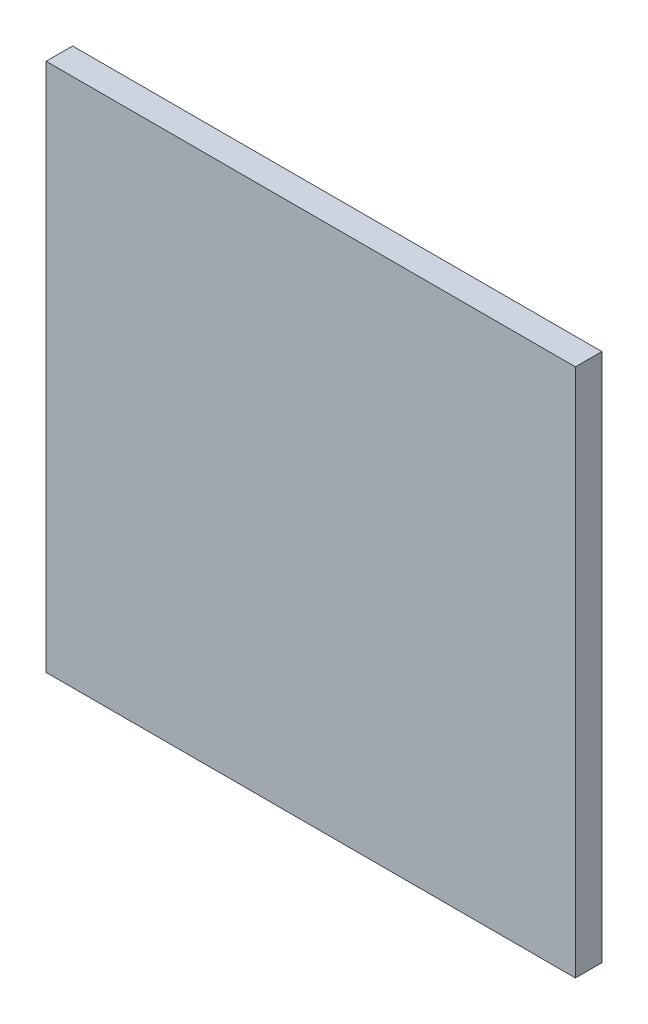
ISO-10303-21;
HEADER;
FILE_DESCRIPTION(('STEP AP214'),'2;1');
FILE_NAME('part.step','',(''),(''),'','','');
FILE_SCHEMA(('AUTOMOTIVE_DESIGN { 1 0 10303 214 1 1 1 1 }'));
ENDSEC;
DATA;
#1=APPLICATION_CONTEXT('core data for automotive mechanical design processes');
#2=APPLICATION_PROTOCOL_DEFINITION('international standard','automotive_design',2000,#1);
#3=PRODUCT_CONTEXT('',#1,'mechanical');
#4=PRODUCT('Part','Part','',(#3));
#5=PRODUCT_RELATED_PRODUCT_CATEGORY('part','',(#4));
#6=PRODUCT_DEFINITION_FORMATION('','',#4);
#7=PRODUCT_DEFINITION_CONTEXT('part definition',#1,'design');
#8=PRODUCT_DEFINITION('design','',#6,#7);
#9=PRODUCT_DEFINITION_SHAPE('','',#8);
#10=(LENGTH_UNIT() NAMED_UNIT(*) SI_UNIT(.MILLI.,.METRE.));
#11=(NAMED_UNIT(*) PLANE_ANGLE_UNIT() SI_UNIT($,.RADIAN.));
#12=(NAMED_UNIT(*) SI_UNIT($,.STERADIAN.) SOLID_ANGLE_UNIT());
#13=UNCERTAINTY_MEASURE_WITH_UNIT(LENGTH_MEASURE(1.E-05),#10,'distance_accuracy_value','');
#14=(GEOMETRIC_REPRESENTATION_CONTEXT(3) GLOBAL_UNCERTAINTY_ASSIGNED_CONTEXT((#13)) GLOBAL_UNIT_ASSIGNED_CONTEXT((#10,
#11,#12)) REPRESENTATION_CONTEXT('',''));
#15=CARTESIAN_POINT('',(0.,0.,0.));
#16=DIRECTION('',(0.,0.,1.));
#17=DIRECTION('',(1.,0.,0.));
#18=AXIS2_PLACEMENT_3D('',#15,#16,#17);
#19=CARTESIAN_POINT('',(0.,0.,1.27));
#20=DIRECTION('',(0.,1.,0.));
#21=DIRECTION('',(0.,0.,1.));
#22=AXIS2_PLACEMENT_3D('',#19,#20,#21);
#23=PLANE('',#22);
#24=DIRECTION('',(1.,0.,0.));
#25=VECTOR('',#24,1.);
#26=CARTESIAN_POINT('',(0.,0.,0.));
#27=LINE('',#26,#25);
#28=CARTESIAN_POINT('',(-25.4,0.,0.));
#29=VERTEX_POINT('',#28);
#30=CARTESIAN_POINT('',(0.,0.,0.));
#31=VERTEX_POINT('',#30);
#32=EDGE_CURVE('E113',#29,#31,#27,.T.);
#33=ORIENTED_EDGE('',*,*,#32,.T.);
#34=DIRECTION('',(0.,0.,-1.));
#35=VECTOR('',#34,1.);
#36=CARTESIAN_POINT('',(0.,0.,1.27));
#37=LINE('',#36,#35);
#38=CARTESIAN_POINT('',(0.,0.,1.27));
#39=VERTEX_POINT('',#38);
#40=EDGE_CURVE('E11',#39,#31,#37,.T.);
#41=ORIENTED_EDGE('',*,*,#40,.F.);
#42=DIRECTION('',(1.,0.,0.));
#43=VECTOR('',#42,1.);
#44=CARTESIAN_POINT('',(0.,0.,1.27));
#45=LINE('',#44,#43);
#46=CARTESIAN_POINT('',(-25.4,0.,1.27));
#47=VERTEX_POINT('',#46);
#48=EDGE_CURVE('E97',#47,#39,#45,.T.);
#49=ORIENTED_EDGE('',*,*,#48,.F.);
#50=DIRECTION('',(0.,0.,-1.));
#51=VECTOR('',#50,1.);
#52=CARTESIAN_POINT('',(-25.4,0.,1.27));
#53=LINE('',#52,#51);
#54=EDGE_CURVE('E109',#47,#29,#53,.T.);
#55=ORIENTED_EDGE('',*,*,#54,.T.);
#56=EDGE_LOOP('',(#33,#41,#49,#55));
#57=FACE_BOUND('',#56,.T.);
#58=ADVANCED_FACE('F45',(#57),#23,.F.);
#59=CARTESIAN_POINT('',(0.,0.,1.27));
#60=DIRECTION('',(-1.,0.,0.));
#61=DIRECTION('',(0.,0.,1.));
#62=AXIS2_PLACEMENT_3D('',#59,#60,#61);
#63=PLANE('',#62);
#64=DIRECTION('',(0.,1.,0.));
#65=VECTOR('',#64,1.);
#66=CARTESIAN_POINT('',(0.,0.,0.));
#67=LINE('',#66,#65);
#68=CARTESIAN_POINT('',(0.,25.4,0.));
#69=VERTEX_POINT('',#68);
#70=EDGE_CURVE('E102',#31,#69,#67,.T.);
#71=ORIENTED_EDGE('',*,*,#70,.T.);
#72=DIRECTION('',(0.,0.,-1.));
#73=VECTOR('',#72,1.);
#74=CARTESIAN_POINT('',(0.,25.4,1.27));
#75=LINE('',#74,#73);
#76=CARTESIAN_POINT('',(0.,25.4,1.27));
#77=VERTEX_POINT('',#76);
#78=EDGE_CURVE('E54',#77,#69,#75,.T.);
#79=ORIENTED_EDGE('',*,*,#78,.F.);
#80=DIRECTION('',(0.,1.,0.));
#81=VECTOR('',#80,1.);
#82=CARTESIAN_POINT('',(0.,0.,1.27));
#83=LINE('',#82,#81);
#84=EDGE_CURVE('E92',#39,#77,#83,.T.);
#85=ORIENTED_EDGE('',*,*,#84,.F.);
#86=ORIENTED_EDGE('',*,*,#40,.T.);
#87=EDGE_LOOP('',(#71,#79,#85,#86));
#88=FACE_BOUND('',#87,.T.);
#89=ADVANCED_FACE('F101',(#88),#63,.F.);
#90=CARTESIAN_POINT('',(0.,25.4,1.27));
#91=DIRECTION('',(0.,-1.,0.));
#92=DIRECTION('',(0.,0.,-1.));
#93=AXIS2_PLACEMENT_3D('',#90,#91,#92);
#94=PLANE('',#93);
#95=DIRECTION('',(-1.,0.,0.));
#96=VECTOR('',#95,1.);
#97=CARTESIAN_POINT('',(0.,25.4,0.));
#98=LINE('',#97,#96);
#99=CARTESIAN_POINT('',(-25.4,25.4,0.));
#100=VERTEX_POINT('',#99);
#101=EDGE_CURVE('E79',#69,#100,#98,.T.);
#102=ORIENTED_EDGE('',*,*,#101,.T.);
#103=DIRECTION('',(0.,0.,-1.));
#104=VECTOR('',#103,1.);
#105=CARTESIAN_POINT('',(-25.4,25.4,1.27));
#106=LINE('',#105,#104);
#107=CARTESIAN_POINT('',(-25.4,25.4,1.27));
#108=VERTEX_POINT('',#107);
#109=EDGE_CURVE('E104',#108,#100,#106,.T.);
#110=ORIENTED_EDGE('',*,*,#109,.F.);
#111=DIRECTION('',(-1.,0.,0.));
#112=VECTOR('',#111,1.);
#113=CARTESIAN_POINT('',(0.,25.4,1.27));
#114=LINE('',#113,#112);
#115=EDGE_CURVE('E95',#77,#108,#114,.T.);
#116=ORIENTED_EDGE('',*,*,#115,.F.);
#117=ORIENTED_EDGE('',*,*,#78,.T.);
#118=EDGE_LOOP('',(#102,#110,#116,#117));
#119=FACE_BOUND('',#118,.T.);
#120=ADVANCED_FACE('F105',(#119),#94,.F.);
#121=CARTESIAN_POINT('',(-25.4,0.,1.27));
#122=DIRECTION('',(1.,0.,0.));
#123=DIRECTION('',(0.,0.,-1.));
#124=AXIS2_PLACEMENT_3D('',#121,#122,#123);
#125=PLANE('',#124);
#126=DIRECTION('',(0.,-1.,0.));
#127=VECTOR('',#126,1.);
#128=CARTESIAN_POINT('',(-25.4,0.,0.));
#129=LINE('',#128,#127);
#130=EDGE_CURVE('E85',#100,#29,#129,.T.);
#131=ORIENTED_EDGE('',*,*,#130,.T.);
#132=ORIENTED_EDGE('',*,*,#54,.F.);
#133=DIRECTION('',(0.,-1.,0.));
#134=VECTOR('',#133,1.);
#135=CARTESIAN_POINT('',(-25.4,0.,1.27));
#136=LINE('',#135,#134);
#137=EDGE_CURVE('E62',#108,#47,#136,.T.);
#138=ORIENTED_EDGE('',*,*,#137,.F.);
#139=ORIENTED_EDGE('',*,*,#109,.T.);
#140=EDGE_LOOP('',(#131,#132,#138,#139));
#141=FACE_BOUND('',#140,.T.);
#142=ADVANCED_FACE('F126',(#141),#125,.F.);
#143=CARTESIAN_POINT('',(0.,0.,1.27));
#144=DIRECTION('',(0.,0.,-1.));
#145=DIRECTION('',(-1.,0.,0.));
#146=AXIS2_PLACEMENT_3D('',#143,#144,#145);
#147=PLANE('',#146);
#148=ORIENTED_EDGE('',*,*,#48,.T.);
#149=ORIENTED_EDGE('',*,*,#84,.T.);
#150=ORIENTED_EDGE('',*,*,#115,.T.);
#151=ORIENTED_EDGE('',*,*,#137,.T.);
#152=EDGE_LOOP('',(#148,#149,#150,#151));
#153=FACE_BOUND('',#152,.T.);
#154=ADVANCED_FACE('F93',(#153),#147,.F.);
#155=CARTESIAN_POINT('',(0.,0.,0.));
#156=DIRECTION('',(0.,0.,-1.));
#157=DIRECTION('',(-1.,0.,0.));
#158=AXIS2_PLACEMENT_3D('',#155,#156,#157);
#159=PLANE('',#158);
#160=ORIENTED_EDGE('',*,*,#32,.F.);
#161=ORIENTED_EDGE('',*,*,#130,.F.);
#162=ORIENTED_EDGE('',*,*,#101,.F.);
#163=ORIENTED_EDGE('',*,*,#70,.F.);
#164=EDGE_LOOP('',(#160,#161,#162,#163));
#165=FACE_BOUND('',#164,.T.);
#166=ADVANCED_FACE('F129',(#165),#159,.T.);
#167=CLOSED_SHELL('',(#58,#89,#120,#142,#154,#166));
#168=MANIFOLD_SOLID_BREP('B2',#167);
#169=ADVANCED_BREP_SHAPE_REPRESENTATION('',(#18,#168),#14);
#170=SHAPE_DEFINITION_REPRESENTATION(#9,#169);
ENDSEC;
END-ISO-10303-21;
